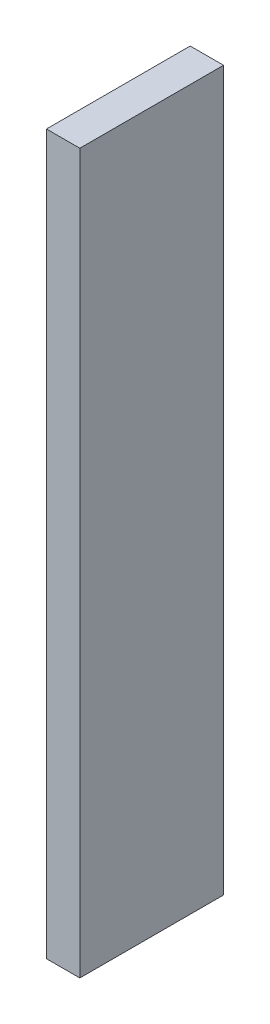
ISO-10303-21;
HEADER;
FILE_DESCRIPTION(('STEP AP214'),'2;1');
FILE_NAME('part.step','',(''),(''),'','','');
FILE_SCHEMA(('AUTOMOTIVE_DESIGN { 1 0 10303 214 1 1 1 1 }'));
ENDSEC;
DATA;
#1=APPLICATION_CONTEXT('core data for automotive mechanical design processes');
#2=APPLICATION_PROTOCOL_DEFINITION('international standard','automotive_design',2000,#1);
#3=PRODUCT_CONTEXT('',#1,'mechanical');
#4=PRODUCT('Part','Part','',(#3));
#5=PRODUCT_RELATED_PRODUCT_CATEGORY('part','',(#4));
#6=PRODUCT_DEFINITION_FORMATION('','',#4);
#7=PRODUCT_DEFINITION_CONTEXT('part definition',#1,'design');
#8=PRODUCT_DEFINITION('design','',#6,#7);
#9=PRODUCT_DEFINITION_SHAPE('','',#8);
#10=(LENGTH_UNIT() NAMED_UNIT(*) SI_UNIT(.MILLI.,.METRE.));
#11=(NAMED_UNIT(*) PLANE_ANGLE_UNIT() SI_UNIT($,.RADIAN.));
#12=(NAMED_UNIT(*) SI_UNIT($,.STERADIAN.) SOLID_ANGLE_UNIT());
#13=UNCERTAINTY_MEASURE_WITH_UNIT(LENGTH_MEASURE(1.E-05),#10,'distance_accuracy_value','');
#14=(GEOMETRIC_REPRESENTATION_CONTEXT(3) GLOBAL_UNCERTAINTY_ASSIGNED_CONTEXT((#13)) GLOBAL_UNIT_ASSIGNED_CONTEXT((#10,
#11,#12)) REPRESENTATION_CONTEXT('',''));
#15=CARTESIAN_POINT('',(0.,0.,0.));
#16=DIRECTION('',(0.,0.,1.));
#17=DIRECTION('',(1.,0.,0.));
#18=AXIS2_PLACEMENT_3D('',#15,#16,#17);
#19=CARTESIAN_POINT('',(-39.,62.5,150.134487690286));
#20=DIRECTION('',(1.,0.,0.));
#21=DIRECTION('',(0.,0.,-1.));
#22=AXIS2_PLACEMENT_3D('',#19,#20,#21);
#23=PLANE('',#22);
#24=DIRECTION('',(0.,-1.,0.));
#25=VECTOR('',#24,1.);
#26=CARTESIAN_POINT('',(-39.,62.5,25.000000038));
#27=LINE('',#26,#25);
#28=CARTESIAN_POINT('',(-39.,62.5,25.000000038));
#29=VERTEX_POINT('',#28);
#30=CARTESIAN_POINT('',(-39.,-62.5,25.000000038));
#31=VERTEX_POINT('',#30);
#32=EDGE_CURVE('E82',#29,#31,#27,.T.);
#33=ORIENTED_EDGE('',*,*,#32,.F.);
#34=DIRECTION('',(0.,0.,-1.));
#35=VECTOR('',#34,1.);
#36=CARTESIAN_POINT('',(-39.,62.5,150.134487690286));
#37=LINE('',#36,#35);
#38=CARTESIAN_POINT('',(-39.,62.5,0.));
#39=VERTEX_POINT('',#38);
#40=EDGE_CURVE('E36',#29,#39,#37,.T.);
#41=ORIENTED_EDGE('',*,*,#40,.T.);
#42=DIRECTION('',(0.,-1.,0.));
#43=VECTOR('',#42,1.);
#44=CARTESIAN_POINT('',(-39.,62.5,0.));
#45=LINE('',#44,#43);
#46=CARTESIAN_POINT('',(-39.,-62.5,0.));
#47=VERTEX_POINT('',#46);
#48=EDGE_CURVE('E80',#39,#47,#45,.T.);
#49=ORIENTED_EDGE('',*,*,#48,.T.);
#50=DIRECTION('',(0.,0.,-1.));
#51=VECTOR('',#50,1.);
#52=CARTESIAN_POINT('',(-39.,-62.5,150.134487690286));
#53=LINE('',#52,#51);
#54=EDGE_CURVE('E71',#31,#47,#53,.T.);
#55=ORIENTED_EDGE('',*,*,#54,.F.);
#56=EDGE_LOOP('',(#33,#41,#49,#55));
#57=FACE_BOUND('',#56,.T.);
#58=ADVANCED_FACE('F32',(#57),#23,.F.);
#59=CARTESIAN_POINT('',(-39.,-62.5,150.134487690286));
#60=DIRECTION('',(0.,1.,0.));
#61=DIRECTION('',(0.,0.,1.));
#62=AXIS2_PLACEMENT_3D('',#59,#60,#61);
#63=PLANE('',#62);
#64=DIRECTION('',(1.,0.,0.));
#65=VECTOR('',#64,1.);
#66=CARTESIAN_POINT('',(-39.,-62.5,25.000000038));
#67=LINE('',#66,#65);
#68=CARTESIAN_POINT('',(-33.2,-62.5,25.000000038));
#69=VERTEX_POINT('',#68);
#70=EDGE_CURVE('E41',#31,#69,#67,.T.);
#71=ORIENTED_EDGE('',*,*,#70,.F.);
#72=ORIENTED_EDGE('',*,*,#54,.T.);
#73=DIRECTION('',(1.,0.,0.));
#74=VECTOR('',#73,1.);
#75=CARTESIAN_POINT('',(-39.,-62.5,0.));
#76=LINE('',#75,#74);
#77=CARTESIAN_POINT('',(-33.2,-62.5,0.));
#78=VERTEX_POINT('',#77);
#79=EDGE_CURVE('E92',#47,#78,#76,.T.);
#80=ORIENTED_EDGE('',*,*,#79,.T.);
#81=DIRECTION('',(0.,0.,-1.));
#82=VECTOR('',#81,1.);
#83=CARTESIAN_POINT('',(-33.2,-62.5,150.134487690286));
#84=LINE('',#83,#82);
#85=EDGE_CURVE('E101',#69,#78,#84,.T.);
#86=ORIENTED_EDGE('',*,*,#85,.F.);
#87=EDGE_LOOP('',(#71,#72,#80,#86));
#88=FACE_BOUND('',#87,.T.);
#89=ADVANCED_FACE('F105',(#88),#63,.F.);
#90=CARTESIAN_POINT('',(-33.2,62.5,150.134487690286));
#91=DIRECTION('',(-1.,0.,0.));
#92=DIRECTION('',(0.,-1.,0.));
#93=AXIS2_PLACEMENT_3D('',#90,#91,#92);
#94=PLANE('',#93);
#95=DIRECTION('',(0.,1.,0.));
#96=VECTOR('',#95,1.);
#97=CARTESIAN_POINT('',(-33.2,62.5,25.000000038));
#98=LINE('',#97,#96);
#99=CARTESIAN_POINT('',(-33.2,62.5,25.000000038));
#100=VERTEX_POINT('',#99);
#101=EDGE_CURVE('E11',#69,#100,#98,.T.);
#102=ORIENTED_EDGE('',*,*,#101,.F.);
#103=ORIENTED_EDGE('',*,*,#85,.T.);
#104=DIRECTION('',(0.,1.,0.));
#105=VECTOR('',#104,1.);
#106=CARTESIAN_POINT('',(-33.2,62.5,0.));
#107=LINE('',#106,#105);
#108=CARTESIAN_POINT('',(-33.2,62.5,0.));
#109=VERTEX_POINT('',#108);
#110=EDGE_CURVE('E102',#78,#109,#107,.T.);
#111=ORIENTED_EDGE('',*,*,#110,.T.);
#112=DIRECTION('',(0.,0.,-1.));
#113=VECTOR('',#112,1.);
#114=CARTESIAN_POINT('',(-33.2,62.5,150.134487690286));
#115=LINE('',#114,#113);
#116=EDGE_CURVE('E54',#100,#109,#115,.T.);
#117=ORIENTED_EDGE('',*,*,#116,.F.);
#118=EDGE_LOOP('',(#102,#103,#111,#117));
#119=FACE_BOUND('',#118,.T.);
#120=ADVANCED_FACE('F104',(#119),#94,.F.);
#121=CARTESIAN_POINT('',(-39.,62.5,150.134487690286));
#122=DIRECTION('',(0.,-1.,0.));
#123=DIRECTION('',(0.,0.,-1.));
#124=AXIS2_PLACEMENT_3D('',#121,#122,#123);
#125=PLANE('',#124);
#126=DIRECTION('',(-1.,0.,0.));
#127=VECTOR('',#126,1.);
#128=CARTESIAN_POINT('',(-39.,62.5,25.000000038));
#129=LINE('',#128,#127);
#130=EDGE_CURVE('E89',#100,#29,#129,.T.);
#131=ORIENTED_EDGE('',*,*,#130,.F.);
#132=ORIENTED_EDGE('',*,*,#116,.T.);
#133=DIRECTION('',(-1.,0.,0.));
#134=VECTOR('',#133,1.);
#135=CARTESIAN_POINT('',(-39.,62.5,0.));
#136=LINE('',#135,#134);
#137=EDGE_CURVE('E85',#109,#39,#136,.T.);
#138=ORIENTED_EDGE('',*,*,#137,.T.);
#139=ORIENTED_EDGE('',*,*,#40,.F.);
#140=EDGE_LOOP('',(#131,#132,#138,#139));
#141=FACE_BOUND('',#140,.T.);
#142=ADVANCED_FACE('F86',(#141),#125,.F.);
#143=CARTESIAN_POINT('',(0.,0.,0.));
#144=DIRECTION('',(0.,0.,1.));
#145=DIRECTION('',(1.,0.,0.));
#146=AXIS2_PLACEMENT_3D('',#143,#144,#145);
#147=PLANE('',#146);
#148=ORIENTED_EDGE('',*,*,#48,.F.);
#149=ORIENTED_EDGE('',*,*,#137,.F.);
#150=ORIENTED_EDGE('',*,*,#110,.F.);
#151=ORIENTED_EDGE('',*,*,#79,.F.);
#152=EDGE_LOOP('',(#148,#149,#150,#151));
#153=FACE_BOUND('',#152,.T.);
#154=ADVANCED_FACE('F91',(#153),#147,.F.);
#155=CARTESIAN_POINT('',(0.,0.,25.000000038));
#156=DIRECTION('',(0.,0.,1.));
#157=DIRECTION('',(1.,0.,0.));
#158=AXIS2_PLACEMENT_3D('',#155,#156,#157);
#159=PLANE('',#158);
#160=ORIENTED_EDGE('',*,*,#130,.T.);
#161=ORIENTED_EDGE('',*,*,#32,.T.);
#162=ORIENTED_EDGE('',*,*,#70,.T.);
#163=ORIENTED_EDGE('',*,*,#101,.T.);
#164=EDGE_LOOP('',(#160,#161,#162,#163));
#165=FACE_BOUND('',#164,.T.);
#166=ADVANCED_FACE('F34',(#165),#159,.T.);
#167=CLOSED_SHELL('',(#58,#89,#120,#142,#154,#166));
#168=MANIFOLD_SOLID_BREP('B2',#167);
#169=ADVANCED_BREP_SHAPE_REPRESENTATION('',(#18,#168),#14);
#170=SHAPE_DEFINITION_REPRESENTATION(#9,#169);
ENDSEC;
END-ISO-10303-21;
